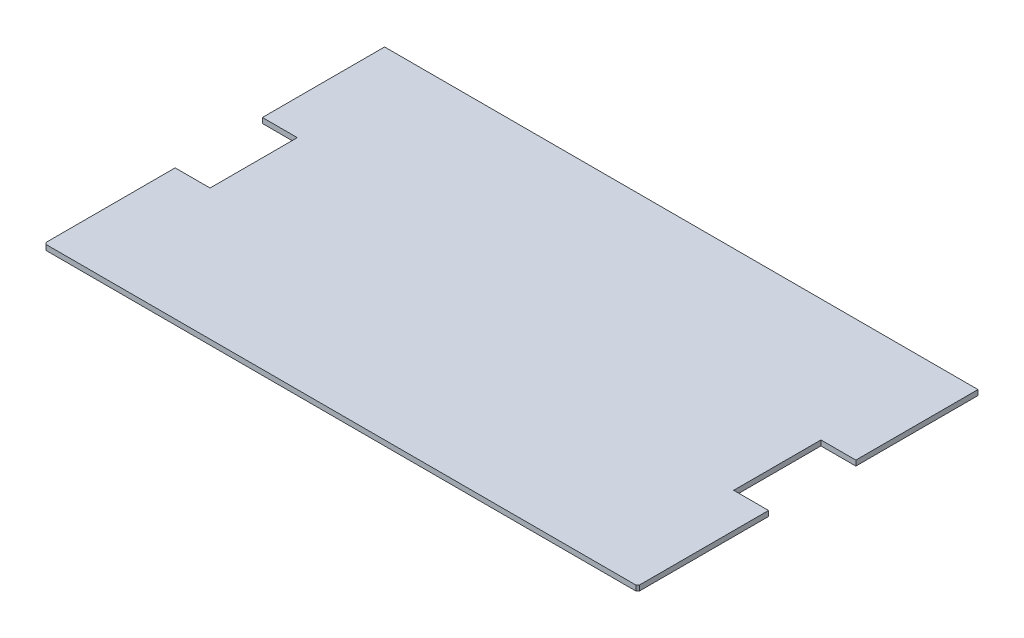
ISO-10303-21;
HEADER;
FILE_DESCRIPTION(('STEP AP214'),'2;1');
FILE_NAME('part.step','',(''),(''),'','','');
FILE_SCHEMA(('AUTOMOTIVE_DESIGN { 1 0 10303 214 1 1 1 1 }'));
ENDSEC;
DATA;
#1=APPLICATION_CONTEXT('core data for automotive mechanical design processes');
#2=APPLICATION_PROTOCOL_DEFINITION('international standard','automotive_design',2000,#1);
#3=PRODUCT_CONTEXT('',#1,'mechanical');
#4=PRODUCT('Part','Part','',(#3));
#5=PRODUCT_RELATED_PRODUCT_CATEGORY('part','',(#4));
#6=PRODUCT_DEFINITION_FORMATION('','',#4);
#7=PRODUCT_DEFINITION_CONTEXT('part definition',#1,'design');
#8=PRODUCT_DEFINITION('design','',#6,#7);
#9=PRODUCT_DEFINITION_SHAPE('','',#8);
#10=(LENGTH_UNIT() NAMED_UNIT(*) SI_UNIT(.MILLI.,.METRE.));
#11=(NAMED_UNIT(*) PLANE_ANGLE_UNIT() SI_UNIT($,.RADIAN.));
#12=(NAMED_UNIT(*) SI_UNIT($,.STERADIAN.) SOLID_ANGLE_UNIT());
#13=UNCERTAINTY_MEASURE_WITH_UNIT(LENGTH_MEASURE(1.E-05),#10,'distance_accuracy_value','');
#14=(GEOMETRIC_REPRESENTATION_CONTEXT(3) GLOBAL_UNCERTAINTY_ASSIGNED_CONTEXT((#13)) GLOBAL_UNIT_ASSIGNED_CONTEXT((#10,
#11,#12)) REPRESENTATION_CONTEXT('',''));
#15=CARTESIAN_POINT('',(0.,0.,0.));
#16=DIRECTION('',(0.,0.,1.));
#17=DIRECTION('',(1.,0.,0.));
#18=AXIS2_PLACEMENT_3D('',#15,#16,#17);
#19=CARTESIAN_POINT('',(-170.,3.,97.5));
#20=DIRECTION('',(0.,0.,-1.));
#21=DIRECTION('',(-1.,0.,0.));
#22=AXIS2_PLACEMENT_3D('',#19,#20,#21);
#23=PLANE('',#22);
#24=DIRECTION('',(1.,0.,0.));
#25=VECTOR('',#24,1.);
#26=CARTESIAN_POINT('',(-170.,0.,97.5));
#27=LINE('',#26,#25);
#28=CARTESIAN_POINT('',(-169.,0.,97.5));
#29=VERTEX_POINT('',#28);
#30=CARTESIAN_POINT('',(169.,0.,97.5));
#31=VERTEX_POINT('',#30);
#32=EDGE_CURVE('E185',#29,#31,#27,.T.);
#33=ORIENTED_EDGE('',*,*,#32,.T.);
#34=DIRECTION('',(0.,1.,0.));
#35=VECTOR('',#34,1.);
#36=CARTESIAN_POINT('',(169.,3.,97.5));
#37=LINE('',#36,#35);
#38=CARTESIAN_POINT('',(169.,3.,97.5));
#39=VERTEX_POINT('',#38);
#40=EDGE_CURVE('E57',#31,#39,#37,.T.);
#41=ORIENTED_EDGE('',*,*,#40,.T.);
#42=DIRECTION('',(1.,0.,0.));
#43=VECTOR('',#42,1.);
#44=CARTESIAN_POINT('',(-170.,3.,97.5));
#45=LINE('',#44,#43);
#46=CARTESIAN_POINT('',(-169.,3.,97.5));
#47=VERTEX_POINT('',#46);
#48=EDGE_CURVE('E148',#47,#39,#45,.T.);
#49=ORIENTED_EDGE('',*,*,#48,.F.);
#50=DIRECTION('',(0.,-1.,0.));
#51=VECTOR('',#50,1.);
#52=CARTESIAN_POINT('',(-169.,3.,97.5));
#53=LINE('',#52,#51);
#54=EDGE_CURVE('E237',#47,#29,#53,.T.);
#55=ORIENTED_EDGE('',*,*,#54,.T.);
#56=EDGE_LOOP('',(#33,#41,#49,#55));
#57=FACE_BOUND('',#56,.T.);
#58=ADVANCED_FACE('F35',(#57),#23,.F.);
#59=CARTESIAN_POINT('',(170.,3.,97.5));
#60=DIRECTION('',(-1.,0.,0.));
#61=DIRECTION('',(0.,0.,1.));
#62=AXIS2_PLACEMENT_3D('',#59,#60,#61);
#63=PLANE('',#62);
#64=DIRECTION('',(0.,0.,-1.));
#65=VECTOR('',#64,1.);
#66=CARTESIAN_POINT('',(170.,3.,97.5));
#67=LINE('',#66,#65);
#68=CARTESIAN_POINT('',(170.,3.,96.5));
#69=VERTEX_POINT('',#68);
#70=CARTESIAN_POINT('',(170.,3.,22.4999999999998));
#71=VERTEX_POINT('',#70);
#72=EDGE_CURVE('E138',#69,#71,#67,.T.);
#73=ORIENTED_EDGE('',*,*,#72,.F.);
#74=DIRECTION('',(0.,-1.,0.));
#75=VECTOR('',#74,1.);
#76=CARTESIAN_POINT('',(170.,3.,96.5));
#77=LINE('',#76,#75);
#78=CARTESIAN_POINT('',(170.,0.,96.5));
#79=VERTEX_POINT('',#78);
#80=EDGE_CURVE('E157',#69,#79,#77,.T.);
#81=ORIENTED_EDGE('',*,*,#80,.T.);
#82=DIRECTION('',(0.,0.,-1.));
#83=VECTOR('',#82,1.);
#84=CARTESIAN_POINT('',(170.,0.,97.5));
#85=LINE('',#84,#83);
#86=CARTESIAN_POINT('',(170.,0.,22.4999999999998));
#87=VERTEX_POINT('',#86);
#88=EDGE_CURVE('E154',#79,#87,#85,.T.);
#89=ORIENTED_EDGE('',*,*,#88,.T.);
#90=DIRECTION('',(0.,-1.,0.));
#91=VECTOR('',#90,1.);
#92=CARTESIAN_POINT('',(170.,3.,22.4999999999998));
#93=LINE('',#92,#91);
#94=EDGE_CURVE('E151',#71,#87,#93,.T.);
#95=ORIENTED_EDGE('',*,*,#94,.F.);
#96=EDGE_LOOP('',(#73,#81,#89,#95));
#97=FACE_BOUND('',#96,.T.);
#98=ADVANCED_FACE('F152',(#97),#63,.F.);
#99=CARTESIAN_POINT('',(170.,3.,22.4999999999998));
#100=DIRECTION('',(0.,0.,1.));
#101=DIRECTION('',(1.,0.,0.));
#102=AXIS2_PLACEMENT_3D('',#99,#100,#101);
#103=PLANE('',#102);
#104=DIRECTION('',(-1.,0.,0.));
#105=VECTOR('',#104,1.);
#106=CARTESIAN_POINT('',(170.,0.,22.4999999999998));
#107=LINE('',#106,#105);
#108=CARTESIAN_POINT('',(150.,0.,22.4999999999999));
#109=VERTEX_POINT('',#108);
#110=EDGE_CURVE('E188',#87,#109,#107,.T.);
#111=ORIENTED_EDGE('',*,*,#110,.T.);
#112=DIRECTION('',(0.,-1.,0.));
#113=VECTOR('',#112,1.);
#114=CARTESIAN_POINT('',(150.,3.,22.4999999999999));
#115=LINE('',#114,#113);
#116=CARTESIAN_POINT('',(150.,3.,22.4999999999999));
#117=VERTEX_POINT('',#116);
#118=EDGE_CURVE('E158',#117,#109,#115,.T.);
#119=ORIENTED_EDGE('',*,*,#118,.F.);
#120=DIRECTION('',(-1.,0.,0.));
#121=VECTOR('',#120,1.);
#122=CARTESIAN_POINT('',(170.,3.,22.4999999999998));
#123=LINE('',#122,#121);
#124=EDGE_CURVE('E142',#71,#117,#123,.T.);
#125=ORIENTED_EDGE('',*,*,#124,.F.);
#126=ORIENTED_EDGE('',*,*,#94,.T.);
#127=EDGE_LOOP('',(#111,#119,#125,#126));
#128=FACE_BOUND('',#127,.T.);
#129=ADVANCED_FACE('F160',(#128),#103,.F.);
#130=CARTESIAN_POINT('',(150.,3.,22.4999999999999));
#131=DIRECTION('',(-1.,0.,0.));
#132=DIRECTION('',(0.,0.,1.));
#133=AXIS2_PLACEMENT_3D('',#130,#131,#132);
#134=PLANE('',#133);
#135=DIRECTION('',(0.,0.,-1.));
#136=VECTOR('',#135,1.);
#137=CARTESIAN_POINT('',(150.,0.,22.4999999999999));
#138=LINE('',#137,#136);
#139=CARTESIAN_POINT('',(150.,0.,-27.5000000000001));
#140=VERTEX_POINT('',#139);
#141=EDGE_CURVE('E190',#109,#140,#138,.T.);
#142=ORIENTED_EDGE('',*,*,#141,.T.);
#143=DIRECTION('',(0.,-1.,0.));
#144=VECTOR('',#143,1.);
#145=CARTESIAN_POINT('',(150.,3.,-27.5000000000001));
#146=LINE('',#145,#144);
#147=CARTESIAN_POINT('',(150.,3.,-27.5000000000001));
#148=VERTEX_POINT('',#147);
#149=EDGE_CURVE('E228',#148,#140,#146,.T.);
#150=ORIENTED_EDGE('',*,*,#149,.F.);
#151=DIRECTION('',(0.,0.,-1.));
#152=VECTOR('',#151,1.);
#153=CARTESIAN_POINT('',(150.,3.,22.4999999999999));
#154=LINE('',#153,#152);
#155=EDGE_CURVE('E163',#117,#148,#154,.T.);
#156=ORIENTED_EDGE('',*,*,#155,.F.);
#157=ORIENTED_EDGE('',*,*,#118,.T.);
#158=EDGE_LOOP('',(#142,#150,#156,#157));
#159=FACE_BOUND('',#158,.T.);
#160=ADVANCED_FACE('F288',(#159),#134,.F.);
#161=CARTESIAN_POINT('',(150.,3.,-27.5000000000001));
#162=DIRECTION('',(0.,0.,-1.));
#163=DIRECTION('',(-1.,0.,0.));
#164=AXIS2_PLACEMENT_3D('',#161,#162,#163);
#165=PLANE('',#164);
#166=DIRECTION('',(1.,0.,0.));
#167=VECTOR('',#166,1.);
#168=CARTESIAN_POINT('',(150.,0.,-27.5000000000001));
#169=LINE('',#168,#167);
#170=CARTESIAN_POINT('',(170.,0.,-27.5000000000001));
#171=VERTEX_POINT('',#170);
#172=EDGE_CURVE('E192',#140,#171,#169,.T.);
#173=ORIENTED_EDGE('',*,*,#172,.T.);
#174=DIRECTION('',(0.,-1.,0.));
#175=VECTOR('',#174,1.);
#176=CARTESIAN_POINT('',(170.,3.,-27.5000000000001));
#177=LINE('',#176,#175);
#178=CARTESIAN_POINT('',(170.,3.,-27.5000000000001));
#179=VERTEX_POINT('',#178);
#180=EDGE_CURVE('E225',#179,#171,#177,.T.);
#181=ORIENTED_EDGE('',*,*,#180,.F.);
#182=DIRECTION('',(1.,0.,0.));
#183=VECTOR('',#182,1.);
#184=CARTESIAN_POINT('',(150.,3.,-27.5000000000001));
#185=LINE('',#184,#183);
#186=EDGE_CURVE('E165',#148,#179,#185,.T.);
#187=ORIENTED_EDGE('',*,*,#186,.F.);
#188=ORIENTED_EDGE('',*,*,#149,.T.);
#189=EDGE_LOOP('',(#173,#181,#187,#188));
#190=FACE_BOUND('',#189,.T.);
#191=ADVANCED_FACE('F284',(#190),#165,.F.);
#192=CARTESIAN_POINT('',(170.,3.,-97.5));
#193=DIRECTION('',(-1.,0.,0.));
#194=DIRECTION('',(0.,0.,1.));
#195=AXIS2_PLACEMENT_3D('',#192,#193,#194);
#196=PLANE('',#195);
#197=DIRECTION('',(0.,0.,-1.));
#198=VECTOR('',#197,1.);
#199=CARTESIAN_POINT('',(170.,0.,-97.5));
#200=LINE('',#199,#198);
#201=CARTESIAN_POINT('',(170.,0.,-97.5));
#202=VERTEX_POINT('',#201);
#203=EDGE_CURVE('E194',#171,#202,#200,.T.);
#204=ORIENTED_EDGE('',*,*,#203,.T.);
#205=DIRECTION('',(0.,-1.,0.));
#206=VECTOR('',#205,1.);
#207=CARTESIAN_POINT('',(170.,3.,-97.5));
#208=LINE('',#207,#206);
#209=CARTESIAN_POINT('',(170.,3.,-97.5));
#210=VERTEX_POINT('',#209);
#211=EDGE_CURVE('E222',#210,#202,#208,.T.);
#212=ORIENTED_EDGE('',*,*,#211,.F.);
#213=DIRECTION('',(0.,0.,-1.));
#214=VECTOR('',#213,1.);
#215=CARTESIAN_POINT('',(170.,3.,-97.5));
#216=LINE('',#215,#214);
#217=EDGE_CURVE('E170',#179,#210,#216,.T.);
#218=ORIENTED_EDGE('',*,*,#217,.F.);
#219=ORIENTED_EDGE('',*,*,#180,.T.);
#220=EDGE_LOOP('',(#204,#212,#218,#219));
#221=FACE_BOUND('',#220,.T.);
#222=ADVANCED_FACE('F280',(#221),#196,.F.);
#223=CARTESIAN_POINT('',(-170.,3.,-97.5));
#224=DIRECTION('',(0.,0.,1.));
#225=DIRECTION('',(1.,0.,0.));
#226=AXIS2_PLACEMENT_3D('',#223,#224,#225);
#227=PLANE('',#226);
#228=DIRECTION('',(-1.,0.,0.));
#229=VECTOR('',#228,1.);
#230=CARTESIAN_POINT('',(-170.,0.,-97.5));
#231=LINE('',#230,#229);
#232=CARTESIAN_POINT('',(-170.,0.,-97.5));
#233=VERTEX_POINT('',#232);
#234=EDGE_CURVE('E196',#202,#233,#231,.T.);
#235=ORIENTED_EDGE('',*,*,#234,.T.);
#236=DIRECTION('',(0.,-1.,0.));
#237=VECTOR('',#236,1.);
#238=CARTESIAN_POINT('',(-170.,3.,-97.5));
#239=LINE('',#238,#237);
#240=CARTESIAN_POINT('',(-170.,3.,-97.5));
#241=VERTEX_POINT('',#240);
#242=EDGE_CURVE('E219',#241,#233,#239,.T.);
#243=ORIENTED_EDGE('',*,*,#242,.F.);
#244=DIRECTION('',(-1.,0.,0.));
#245=VECTOR('',#244,1.);
#246=CARTESIAN_POINT('',(-170.,3.,-97.5));
#247=LINE('',#246,#245);
#248=EDGE_CURVE('E172',#210,#241,#247,.T.);
#249=ORIENTED_EDGE('',*,*,#248,.F.);
#250=ORIENTED_EDGE('',*,*,#211,.T.);
#251=EDGE_LOOP('',(#235,#243,#249,#250));
#252=FACE_BOUND('',#251,.T.);
#253=ADVANCED_FACE('F275',(#252),#227,.F.);
#254=CARTESIAN_POINT('',(-170.,3.,-27.5000000000001));
#255=DIRECTION('',(1.,0.,0.));
#256=DIRECTION('',(0.,0.,-1.));
#257=AXIS2_PLACEMENT_3D('',#254,#255,#256);
#258=PLANE('',#257);
#259=DIRECTION('',(0.,0.,1.));
#260=VECTOR('',#259,1.);
#261=CARTESIAN_POINT('',(-170.,0.,-27.5000000000001));
#262=LINE('',#261,#260);
#263=CARTESIAN_POINT('',(-170.,0.,-27.5000000000001));
#264=VERTEX_POINT('',#263);
#265=EDGE_CURVE('E198',#233,#264,#262,.T.);
#266=ORIENTED_EDGE('',*,*,#265,.T.);
#267=DIRECTION('',(0.,-1.,0.));
#268=VECTOR('',#267,1.);
#269=CARTESIAN_POINT('',(-170.,3.,-27.5000000000001));
#270=LINE('',#269,#268);
#271=CARTESIAN_POINT('',(-170.,3.,-27.5000000000001));
#272=VERTEX_POINT('',#271);
#273=EDGE_CURVE('E216',#272,#264,#270,.T.);
#274=ORIENTED_EDGE('',*,*,#273,.F.);
#275=DIRECTION('',(0.,0.,1.));
#276=VECTOR('',#275,1.);
#277=CARTESIAN_POINT('',(-170.,3.,-27.5000000000001));
#278=LINE('',#277,#276);
#279=EDGE_CURVE('E174',#241,#272,#278,.T.);
#280=ORIENTED_EDGE('',*,*,#279,.F.);
#281=ORIENTED_EDGE('',*,*,#242,.T.);
#282=EDGE_LOOP('',(#266,#274,#280,#281));
#283=FACE_BOUND('',#282,.T.);
#284=ADVANCED_FACE('F269',(#283),#258,.F.);
#285=CARTESIAN_POINT('',(-150.,3.,-27.5000000000001));
#286=DIRECTION('',(0.,0.,-1.));
#287=DIRECTION('',(-1.,0.,0.));
#288=AXIS2_PLACEMENT_3D('',#285,#286,#287);
#289=PLANE('',#288);
#290=DIRECTION('',(1.,0.,0.));
#291=VECTOR('',#290,1.);
#292=CARTESIAN_POINT('',(-150.,0.,-27.5000000000001));
#293=LINE('',#292,#291);
#294=CARTESIAN_POINT('',(-150.,0.,-27.5000000000001));
#295=VERTEX_POINT('',#294);
#296=EDGE_CURVE('E200',#264,#295,#293,.T.);
#297=ORIENTED_EDGE('',*,*,#296,.T.);
#298=DIRECTION('',(0.,-1.,0.));
#299=VECTOR('',#298,1.);
#300=CARTESIAN_POINT('',(-150.,3.,-27.5000000000001));
#301=LINE('',#300,#299);
#302=CARTESIAN_POINT('',(-150.,3.,-27.5000000000001));
#303=VERTEX_POINT('',#302);
#304=EDGE_CURVE('E213',#303,#295,#301,.T.);
#305=ORIENTED_EDGE('',*,*,#304,.F.);
#306=DIRECTION('',(1.,0.,0.));
#307=VECTOR('',#306,1.);
#308=CARTESIAN_POINT('',(-150.,3.,-27.5000000000001));
#309=LINE('',#308,#307);
#310=EDGE_CURVE('E176',#272,#303,#309,.T.);
#311=ORIENTED_EDGE('',*,*,#310,.F.);
#312=ORIENTED_EDGE('',*,*,#273,.T.);
#313=EDGE_LOOP('',(#297,#305,#311,#312));
#314=FACE_BOUND('',#313,.T.);
#315=ADVANCED_FACE('F265',(#314),#289,.F.);
#316=CARTESIAN_POINT('',(-150.,3.,22.4999999999998));
#317=DIRECTION('',(1.,0.,0.));
#318=DIRECTION('',(0.,0.,-1.));
#319=AXIS2_PLACEMENT_3D('',#316,#317,#318);
#320=PLANE('',#319);
#321=DIRECTION('',(0.,0.,1.));
#322=VECTOR('',#321,1.);
#323=CARTESIAN_POINT('',(-150.,0.,22.4999999999998));
#324=LINE('',#323,#322);
#325=CARTESIAN_POINT('',(-150.,0.,22.4999999999998));
#326=VERTEX_POINT('',#325);
#327=EDGE_CURVE('E202',#295,#326,#324,.T.);
#328=ORIENTED_EDGE('',*,*,#327,.T.);
#329=DIRECTION('',(0.,-1.,0.));
#330=VECTOR('',#329,1.);
#331=CARTESIAN_POINT('',(-150.,3.,22.4999999999998));
#332=LINE('',#331,#330);
#333=CARTESIAN_POINT('',(-150.,3.,22.4999999999998));
#334=VERTEX_POINT('',#333);
#335=EDGE_CURVE('E210',#334,#326,#332,.T.);
#336=ORIENTED_EDGE('',*,*,#335,.F.);
#337=DIRECTION('',(0.,0.,1.));
#338=VECTOR('',#337,1.);
#339=CARTESIAN_POINT('',(-150.,3.,22.4999999999998));
#340=LINE('',#339,#338);
#341=EDGE_CURVE('E178',#303,#334,#340,.T.);
#342=ORIENTED_EDGE('',*,*,#341,.F.);
#343=ORIENTED_EDGE('',*,*,#304,.T.);
#344=EDGE_LOOP('',(#328,#336,#342,#343));
#345=FACE_BOUND('',#344,.T.);
#346=ADVANCED_FACE('F260',(#345),#320,.F.);
#347=CARTESIAN_POINT('',(-170.,3.,22.4999999999999));
#348=DIRECTION('',(0.,0.,1.));
#349=DIRECTION('',(1.,0.,0.));
#350=AXIS2_PLACEMENT_3D('',#347,#348,#349);
#351=PLANE('',#350);
#352=DIRECTION('',(-1.,0.,0.));
#353=VECTOR('',#352,1.);
#354=CARTESIAN_POINT('',(-170.,0.,22.4999999999999));
#355=LINE('',#354,#353);
#356=CARTESIAN_POINT('',(-170.,0.,22.4999999999999));
#357=VERTEX_POINT('',#356);
#358=EDGE_CURVE('E204',#326,#357,#355,.T.);
#359=ORIENTED_EDGE('',*,*,#358,.T.);
#360=DIRECTION('',(0.,-1.,0.));
#361=VECTOR('',#360,1.);
#362=CARTESIAN_POINT('',(-170.,3.,22.4999999999999));
#363=LINE('',#362,#361);
#364=CARTESIAN_POINT('',(-170.,3.,22.4999999999999));
#365=VERTEX_POINT('',#364);
#366=EDGE_CURVE('E184',#365,#357,#363,.T.);
#367=ORIENTED_EDGE('',*,*,#366,.F.);
#368=DIRECTION('',(-1.,0.,0.));
#369=VECTOR('',#368,1.);
#370=CARTESIAN_POINT('',(-170.,3.,22.4999999999999));
#371=LINE('',#370,#369);
#372=EDGE_CURVE('E180',#334,#365,#371,.T.);
#373=ORIENTED_EDGE('',*,*,#372,.F.);
#374=ORIENTED_EDGE('',*,*,#335,.T.);
#375=EDGE_LOOP('',(#359,#367,#373,#374));
#376=FACE_BOUND('',#375,.T.);
#377=ADVANCED_FACE('F254',(#376),#351,.F.);
#378=CARTESIAN_POINT('',(-170.,3.,97.5));
#379=DIRECTION('',(1.,0.,0.));
#380=DIRECTION('',(0.,0.,-1.));
#381=AXIS2_PLACEMENT_3D('',#378,#379,#380);
#382=PLANE('',#381);
#383=DIRECTION('',(0.,0.,1.));
#384=VECTOR('',#383,1.);
#385=CARTESIAN_POINT('',(-170.,0.,97.5));
#386=LINE('',#385,#384);
#387=CARTESIAN_POINT('',(-170.,0.,96.5));
#388=VERTEX_POINT('',#387);
#389=EDGE_CURVE('E206',#357,#388,#386,.T.);
#390=ORIENTED_EDGE('',*,*,#389,.T.);
#391=DIRECTION('',(0.,1.,0.));
#392=VECTOR('',#391,1.);
#393=CARTESIAN_POINT('',(-170.,3.,96.5));
#394=LINE('',#393,#392);
#395=CARTESIAN_POINT('',(-170.,3.,96.5));
#396=VERTEX_POINT('',#395);
#397=EDGE_CURVE('E11',#388,#396,#394,.T.);
#398=ORIENTED_EDGE('',*,*,#397,.T.);
#399=DIRECTION('',(0.,0.,1.));
#400=VECTOR('',#399,1.);
#401=CARTESIAN_POINT('',(-170.,3.,97.5));
#402=LINE('',#401,#400);
#403=EDGE_CURVE('E182',#365,#396,#402,.T.);
#404=ORIENTED_EDGE('',*,*,#403,.F.);
#405=ORIENTED_EDGE('',*,*,#366,.T.);
#406=EDGE_LOOP('',(#390,#398,#404,#405));
#407=FACE_BOUND('',#406,.T.);
#408=ADVANCED_FACE('F250',(#407),#382,.F.);
#409=CARTESIAN_POINT('',(0.,3.,0.));
#410=DIRECTION('',(0.,1.,0.));
#411=DIRECTION('',(0.,0.,1.));
#412=AXIS2_PLACEMENT_3D('',#409,#410,#411);
#413=PLANE('',#412);
#414=ORIENTED_EDGE('',*,*,#48,.T.);
#415=DIRECTION('',(-0.707106781186548,0.,0.707106781186548));
#416=VECTOR('',#415,1.);
#417=CARTESIAN_POINT('',(133.25,3.,133.25));
#418=LINE('',#417,#416);
#419=EDGE_CURVE('E44',#39,#69,#418,.F.);
#420=ORIENTED_EDGE('',*,*,#419,.T.);
#421=ORIENTED_EDGE('',*,*,#72,.T.);
#422=ORIENTED_EDGE('',*,*,#124,.T.);
#423=ORIENTED_EDGE('',*,*,#155,.T.);
#424=ORIENTED_EDGE('',*,*,#186,.T.);
#425=ORIENTED_EDGE('',*,*,#217,.T.);
#426=ORIENTED_EDGE('',*,*,#248,.T.);
#427=ORIENTED_EDGE('',*,*,#279,.T.);
#428=ORIENTED_EDGE('',*,*,#310,.T.);
#429=ORIENTED_EDGE('',*,*,#341,.T.);
#430=ORIENTED_EDGE('',*,*,#372,.T.);
#431=ORIENTED_EDGE('',*,*,#403,.T.);
#432=DIRECTION('',(-0.707106781186548,0.,-0.707106781186548));
#433=VECTOR('',#432,1.);
#434=CARTESIAN_POINT('',(-133.25,3.,133.25));
#435=LINE('',#434,#433);
#436=EDGE_CURVE('E241',#396,#47,#435,.F.);
#437=ORIENTED_EDGE('',*,*,#436,.T.);
#438=EDGE_LOOP('',(#414,#420,#421,#422,#423,#424,#425,#426,#427,#428,#429,#430,#431,#437));
#439=FACE_BOUND('',#438,.T.);
#440=ADVANCED_FACE('F140',(#439),#413,.T.);
#441=CARTESIAN_POINT('',(0.,0.,0.));
#442=DIRECTION('',(0.,1.,0.));
#443=DIRECTION('',(0.,0.,1.));
#444=AXIS2_PLACEMENT_3D('',#441,#442,#443);
#445=PLANE('',#444);
#446=ORIENTED_EDGE('',*,*,#88,.F.);
#447=DIRECTION('',(0.707106781186548,0.,-0.707106781186548));
#448=VECTOR('',#447,1.);
#449=CARTESIAN_POINT('',(170.,0.,96.5));
#450=LINE('',#449,#448);
#451=EDGE_CURVE('E235',#79,#31,#450,.F.);
#452=ORIENTED_EDGE('',*,*,#451,.T.);
#453=ORIENTED_EDGE('',*,*,#32,.F.);
#454=DIRECTION('',(0.707106781186548,0.,0.707106781186548));
#455=VECTOR('',#454,1.);
#456=CARTESIAN_POINT('',(-169.,0.,97.5));
#457=LINE('',#456,#455);
#458=EDGE_CURVE('E233',#29,#388,#457,.F.);
#459=ORIENTED_EDGE('',*,*,#458,.T.);
#460=ORIENTED_EDGE('',*,*,#389,.F.);
#461=ORIENTED_EDGE('',*,*,#358,.F.);
#462=ORIENTED_EDGE('',*,*,#327,.F.);
#463=ORIENTED_EDGE('',*,*,#296,.F.);
#464=ORIENTED_EDGE('',*,*,#265,.F.);
#465=ORIENTED_EDGE('',*,*,#234,.F.);
#466=ORIENTED_EDGE('',*,*,#203,.F.);
#467=ORIENTED_EDGE('',*,*,#172,.F.);
#468=ORIENTED_EDGE('',*,*,#141,.F.);
#469=ORIENTED_EDGE('',*,*,#110,.F.);
#470=EDGE_LOOP('',(#446,#452,#453,#459,#460,#461,#462,#463,#464,#465,#466,#467,#468,#469));
#471=FACE_BOUND('',#470,.T.);
#472=ADVANCED_FACE('F248',(#471),#445,.F.);
#473=CARTESIAN_POINT('',(170.,3.,96.5));
#474=DIRECTION('',(-0.707106781186547,0.,-0.707106781186547));
#475=DIRECTION('',(0.,-1.,0.));
#476=AXIS2_PLACEMENT_3D('',#473,#474,#475);
#477=PLANE('',#476);
#478=ORIENTED_EDGE('',*,*,#419,.F.);
#479=ORIENTED_EDGE('',*,*,#40,.F.);
#480=ORIENTED_EDGE('',*,*,#451,.F.);
#481=ORIENTED_EDGE('',*,*,#80,.F.);
#482=EDGE_LOOP('',(#478,#479,#480,#481));
#483=FACE_BOUND('',#482,.T.);
#484=ADVANCED_FACE('F304',(#483),#477,.F.);
#485=CARTESIAN_POINT('',(-169.,3.,97.5));
#486=DIRECTION('',(0.707106781186547,0.,-0.707106781186547));
#487=DIRECTION('',(0.,-1.,0.));
#488=AXIS2_PLACEMENT_3D('',#485,#486,#487);
#489=PLANE('',#488);
#490=ORIENTED_EDGE('',*,*,#436,.F.);
#491=ORIENTED_EDGE('',*,*,#397,.F.);
#492=ORIENTED_EDGE('',*,*,#458,.F.);
#493=ORIENTED_EDGE('',*,*,#54,.F.);
#494=EDGE_LOOP('',(#490,#491,#492,#493));
#495=FACE_BOUND('',#494,.T.);
#496=ADVANCED_FACE('F38',(#495),#489,.F.);
#497=CLOSED_SHELL('',(#58,#98,#129,#160,#191,#222,#253,#284,#315,#346,#377,#408,#440,#472,#484,#496));
#498=MANIFOLD_SOLID_BREP('B2',#497);
#499=ADVANCED_BREP_SHAPE_REPRESENTATION('',(#18,#498),#14);
#500=SHAPE_DEFINITION_REPRESENTATION(#9,#499);
ENDSEC;
END-ISO-10303-21;
